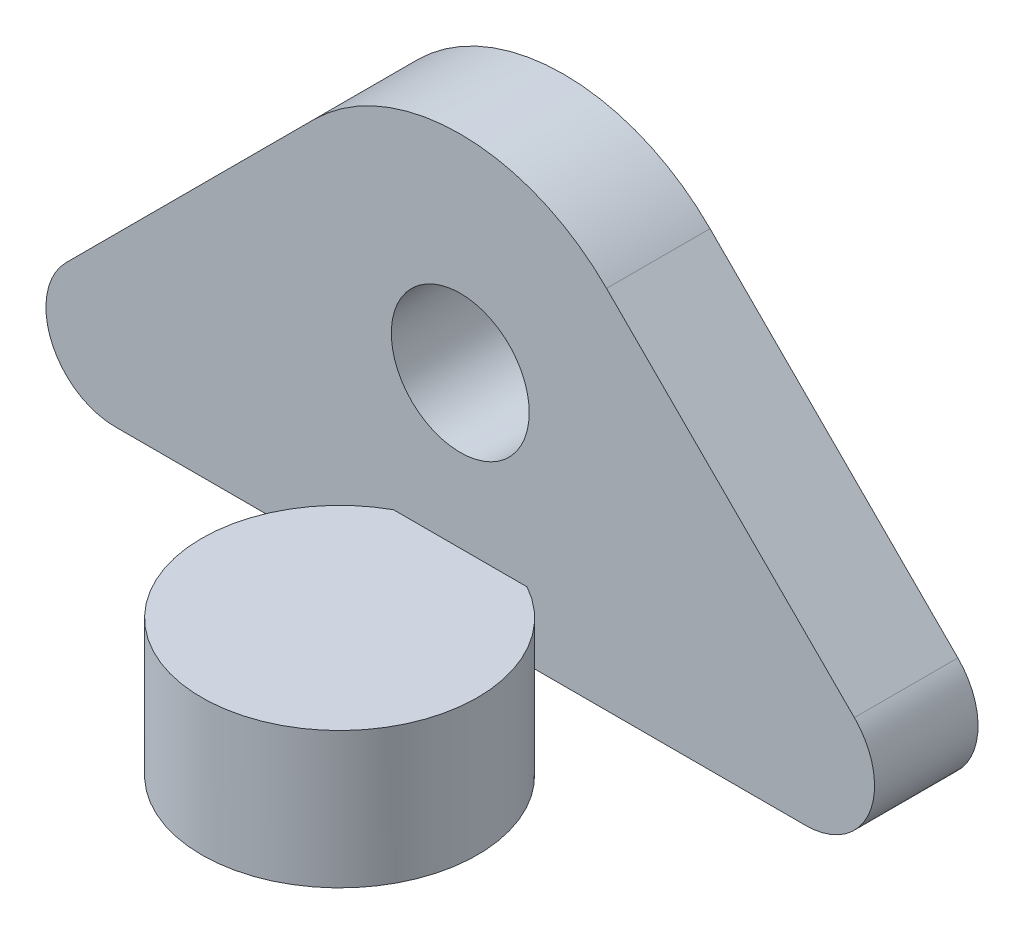
ISO-10303-21;
HEADER;
FILE_DESCRIPTION(('STEP AP214'),'2;1');
FILE_NAME('part.step','',(''),(''),'','','');
FILE_SCHEMA(('AUTOMOTIVE_DESIGN { 1 0 10303 214 1 1 1 1 }'));
ENDSEC;
DATA;
#1=APPLICATION_CONTEXT('core data for automotive mechanical design processes');
#2=APPLICATION_PROTOCOL_DEFINITION('international standard','automotive_design',2000,#1);
#3=PRODUCT_CONTEXT('',#1,'mechanical');
#4=PRODUCT('Part','Part','',(#3));
#5=PRODUCT_RELATED_PRODUCT_CATEGORY('part','',(#4));
#6=PRODUCT_DEFINITION_FORMATION('','',#4);
#7=PRODUCT_DEFINITION_CONTEXT('part definition',#1,'design');
#8=PRODUCT_DEFINITION('design','',#6,#7);
#9=PRODUCT_DEFINITION_SHAPE('','',#8);
#10=(LENGTH_UNIT() NAMED_UNIT(*) SI_UNIT(.MILLI.,.METRE.));
#11=(NAMED_UNIT(*) PLANE_ANGLE_UNIT() SI_UNIT($,.RADIAN.));
#12=(NAMED_UNIT(*) SI_UNIT($,.STERADIAN.) SOLID_ANGLE_UNIT());
#13=UNCERTAINTY_MEASURE_WITH_UNIT(LENGTH_MEASURE(1.E-05),#10,'distance_accuracy_value','');
#14=(GEOMETRIC_REPRESENTATION_CONTEXT(3) GLOBAL_UNCERTAINTY_ASSIGNED_CONTEXT((#13)) GLOBAL_UNIT_ASSIGNED_CONTEXT((#10,
#11,#12)) REPRESENTATION_CONTEXT('',''));
#15=CARTESIAN_POINT('',(0.,0.,0.));
#16=DIRECTION('',(0.,0.,1.));
#17=DIRECTION('',(1.,0.,0.));
#18=AXIS2_PLACEMENT_3D('',#15,#16,#17);
#19=CARTESIAN_POINT('',(-8.0772,-3.51536,-2.42062));
#20=DIRECTION('',(0.,0.,1.));
#21=DIRECTION('',(1.,0.,0.));
#22=AXIS2_PLACEMENT_3D('',#19,#20,#21);
#23=CYLINDRICAL_SURFACE('',#22,1.6129);
#24=CARTESIAN_POINT('',(-8.0772,-3.51536,0.));
#25=DIRECTION('',(0.,0.,1.));
#26=DIRECTION('',(1.,0.,0.));
#27=AXIS2_PLACEMENT_3D('',#24,#25,#26);
#28=CIRCLE('',#27,1.6129);
#29=CARTESIAN_POINT('',(-9.21770532769004,-2.37488027308214,0.));
#30=VERTEX_POINT('',#29);
#31=CARTESIAN_POINT('',(-8.0772,-5.12826,0.));
#32=VERTEX_POINT('',#31);
#33=EDGE_CURVE('E130',#30,#32,#28,.T.);
#34=ORIENTED_EDGE('',*,*,#33,.F.);
#35=DIRECTION('',(0.,0.,1.));
#36=VECTOR('',#35,1.);
#37=CARTESIAN_POINT('',(-9.21770532769004,-2.37488027308214,-2.42062));
#38=LINE('',#37,#36);
#39=CARTESIAN_POINT('',(-9.21770532769004,-2.37488027308214,-2.42062));
#40=VERTEX_POINT('',#39);
#41=EDGE_CURVE('E54',#40,#30,#38,.T.);
#42=ORIENTED_EDGE('',*,*,#41,.F.);
#43=CARTESIAN_POINT('',(-8.0772,-3.51536,-2.42062));
#44=DIRECTION('',(0.,0.,1.));
#45=DIRECTION('',(1.,0.,0.));
#46=AXIS2_PLACEMENT_3D('',#43,#44,#45);
#47=CIRCLE('',#46,1.6129);
#48=CARTESIAN_POINT('',(-8.0772,-5.12826,-2.42062));
#49=VERTEX_POINT('',#48);
#50=EDGE_CURVE('E147',#40,#49,#47,.T.);
#51=ORIENTED_EDGE('',*,*,#50,.T.);
#52=DIRECTION('',(0.,0.,1.));
#53=VECTOR('',#52,1.);
#54=CARTESIAN_POINT('',(-8.0772,-5.12826,-2.42062));
#55=LINE('',#54,#53);
#56=EDGE_CURVE('E87',#49,#32,#55,.T.);
#57=ORIENTED_EDGE('',*,*,#56,.T.);
#58=EDGE_LOOP('',(#34,#42,#51,#57));
#59=FACE_BOUND('',#58,.T.);
#60=ADVANCED_FACE('F32',(#59),#23,.T.);
#61=CARTESIAN_POINT('',(-9.21770532769004,-2.37488027308214,-2.42062));
#62=DIRECTION('',(-0.707114717397258,0.707098844886764,0.));
#63=DIRECTION('',(-0.707098844886764,-0.707114717397258,0.));
#64=AXIS2_PLACEMENT_3D('',#61,#62,#63);
#65=PLANE('',#64);
#66=DIRECTION('',(-0.707098844886764,-0.707114717397258,0.));
#67=VECTOR('',#66,1.);
#68=CARTESIAN_POINT('',(-9.21770532769004,-2.37488027308214,0.));
#69=LINE('',#68,#67);
#70=CARTESIAN_POINT('',(-3.42151598307011,3.42143918075358,0.));
#71=VERTEX_POINT('',#70);
#72=EDGE_CURVE('E144',#71,#30,#69,.T.);
#73=ORIENTED_EDGE('',*,*,#72,.F.);
#74=DIRECTION('',(0.,0.,1.));
#75=VECTOR('',#74,1.);
#76=CARTESIAN_POINT('',(-3.42151598307011,3.42143918075358,-2.42062));
#77=LINE('',#76,#75);
#78=CARTESIAN_POINT('',(-3.42151598307011,3.42143918075358,-2.42062));
#79=VERTEX_POINT('',#78);
#80=EDGE_CURVE('E111',#79,#71,#77,.T.);
#81=ORIENTED_EDGE('',*,*,#80,.F.);
#82=DIRECTION('',(-0.707098844886764,-0.707114717397258,0.));
#83=VECTOR('',#82,1.);
#84=CARTESIAN_POINT('',(-9.21770532769004,-2.37488027308214,-2.42062));
#85=LINE('',#84,#83);
#86=EDGE_CURVE('E120',#79,#40,#85,.T.);
#87=ORIENTED_EDGE('',*,*,#86,.T.);
#88=ORIENTED_EDGE('',*,*,#41,.T.);
#89=EDGE_LOOP('',(#73,#81,#87,#88));
#90=FACE_BOUND('',#89,.T.);
#91=ADVANCED_FACE('F217',(#90),#65,.T.);
#92=CARTESIAN_POINT('',(0.,0.,-2.42062));
#93=DIRECTION('',(0.,0.,1.));
#94=DIRECTION('',(1.,0.,0.));
#95=AXIS2_PLACEMENT_3D('',#92,#93,#94);
#96=CYLINDRICAL_SURFACE('',#95,4.8387);
#97=CARTESIAN_POINT('',(0.,0.,0.));
#98=DIRECTION('',(0.,0.,1.));
#99=DIRECTION('',(1.,0.,0.));
#100=AXIS2_PLACEMENT_3D('',#97,#98,#99);
#101=CIRCLE('',#100,4.8387);
#102=CARTESIAN_POINT('',(3.42151598307011,3.42143918075358,0.));
#103=VERTEX_POINT('',#102);
#104=EDGE_CURVE('E106',#103,#71,#101,.T.);
#105=ORIENTED_EDGE('',*,*,#104,.F.);
#106=DIRECTION('',(0.,0.,1.));
#107=VECTOR('',#106,1.);
#108=CARTESIAN_POINT('',(3.42151598307011,3.42143918075358,-2.42062));
#109=LINE('',#108,#107);
#110=CARTESIAN_POINT('',(3.42151598307011,3.42143918075358,-2.42062));
#111=VERTEX_POINT('',#110);
#112=EDGE_CURVE('E100',#111,#103,#109,.T.);
#113=ORIENTED_EDGE('',*,*,#112,.F.);
#114=CARTESIAN_POINT('',(0.,0.,-2.42062));
#115=DIRECTION('',(0.,0.,1.));
#116=DIRECTION('',(1.,0.,0.));
#117=AXIS2_PLACEMENT_3D('',#114,#115,#116);
#118=CIRCLE('',#117,4.8387);
#119=EDGE_CURVE('E103',#111,#79,#118,.T.);
#120=ORIENTED_EDGE('',*,*,#119,.T.);
#121=ORIENTED_EDGE('',*,*,#80,.T.);
#122=EDGE_LOOP('',(#105,#113,#120,#121));
#123=FACE_BOUND('',#122,.T.);
#124=ADVANCED_FACE('F102',(#123),#96,.T.);
#125=CARTESIAN_POINT('',(3.42151598307011,3.42143918075358,-2.42062));
#126=DIRECTION('',(0.707114717397258,0.707098844886764,0.));
#127=DIRECTION('',(-0.707098844886764,0.707114717397258,0.));
#128=AXIS2_PLACEMENT_3D('',#125,#126,#127);
#129=PLANE('',#128);
#130=DIRECTION('',(-0.707098844886764,0.707114717397258,0.));
#131=VECTOR('',#130,1.);
#132=CARTESIAN_POINT('',(3.42151598307011,3.42143918075358,0.));
#133=LINE('',#132,#131);
#134=CARTESIAN_POINT('',(9.21770532769004,-2.37488027308214,0.));
#135=VERTEX_POINT('',#134);
#136=EDGE_CURVE('E141',#135,#103,#133,.T.);
#137=ORIENTED_EDGE('',*,*,#136,.F.);
#138=DIRECTION('',(0.,0.,1.));
#139=VECTOR('',#138,1.);
#140=CARTESIAN_POINT('',(9.21770532769004,-2.37488027308214,-2.42062));
#141=LINE('',#140,#139);
#142=CARTESIAN_POINT('',(9.21770532769004,-2.37488027308214,-2.42062));
#143=VERTEX_POINT('',#142);
#144=EDGE_CURVE('E112',#143,#135,#141,.T.);
#145=ORIENTED_EDGE('',*,*,#144,.F.);
#146=DIRECTION('',(-0.707098844886764,0.707114717397258,0.));
#147=VECTOR('',#146,1.);
#148=CARTESIAN_POINT('',(3.42151598307011,3.42143918075358,-2.42062));
#149=LINE('',#148,#147);
#150=EDGE_CURVE('E118',#143,#111,#149,.T.);
#151=ORIENTED_EDGE('',*,*,#150,.T.);
#152=ORIENTED_EDGE('',*,*,#112,.T.);
#153=EDGE_LOOP('',(#137,#145,#151,#152));
#154=FACE_BOUND('',#153,.T.);
#155=ADVANCED_FACE('F122',(#154),#129,.T.);
#156=CARTESIAN_POINT('',(8.0772,-3.51536,-2.42062));
#157=DIRECTION('',(0.,0.,1.));
#158=DIRECTION('',(1.,0.,0.));
#159=AXIS2_PLACEMENT_3D('',#156,#157,#158);
#160=CYLINDRICAL_SURFACE('',#159,1.6129);
#161=CARTESIAN_POINT('',(8.0772,-3.51536,0.));
#162=DIRECTION('',(0.,0.,1.));
#163=DIRECTION('',(1.,0.,0.));
#164=AXIS2_PLACEMENT_3D('',#161,#162,#163);
#165=CIRCLE('',#164,1.6129);
#166=CARTESIAN_POINT('',(8.0772,-5.12826,0.));
#167=VERTEX_POINT('',#166);
#168=EDGE_CURVE('E138',#167,#135,#165,.T.);
#169=ORIENTED_EDGE('',*,*,#168,.F.);
#170=DIRECTION('',(0.,0.,1.));
#171=VECTOR('',#170,1.);
#172=CARTESIAN_POINT('',(8.0772,-5.12826,-2.42062));
#173=LINE('',#172,#171);
#174=CARTESIAN_POINT('',(8.0772,-5.12826,-2.42062));
#175=VERTEX_POINT('',#174);
#176=EDGE_CURVE('E152',#175,#167,#173,.T.);
#177=ORIENTED_EDGE('',*,*,#176,.F.);
#178=CARTESIAN_POINT('',(8.0772,-3.51536,-2.42062));
#179=DIRECTION('',(0.,0.,1.));
#180=DIRECTION('',(1.,0.,0.));
#181=AXIS2_PLACEMENT_3D('',#178,#179,#180);
#182=CIRCLE('',#181,1.6129);
#183=EDGE_CURVE('E123',#175,#143,#182,.T.);
#184=ORIENTED_EDGE('',*,*,#183,.T.);
#185=ORIENTED_EDGE('',*,*,#144,.T.);
#186=EDGE_LOOP('',(#169,#177,#184,#185));
#187=FACE_BOUND('',#186,.T.);
#188=ADVANCED_FACE('F231',(#187),#160,.T.);
#189=CARTESIAN_POINT('',(-8.0772,-5.12826,-2.42062));
#190=DIRECTION('',(0.,-1.,0.));
#191=DIRECTION('',(0.,0.,-1.));
#192=AXIS2_PLACEMENT_3D('',#189,#190,#191);
#193=PLANE('',#192);
#194=CARTESIAN_POINT('',(0.,-5.12826,2.82194));
#195=DIRECTION('',(0.,-1.,0.));
#196=DIRECTION('',(0.,0.,-1.));
#197=AXIS2_PLACEMENT_3D('',#194,#195,#196);
#198=CIRCLE('',#197,3.2258);
#199=CARTESIAN_POINT('',(-1.56283085341952,-5.12826,0.));
#200=VERTEX_POINT('',#199);
#201=CARTESIAN_POINT('',(1.56283085341952,-5.12826,0.));
#202=VERTEX_POINT('',#201);
#203=EDGE_CURVE('E166',#200,#202,#198,.T.);
#204=ORIENTED_EDGE('',*,*,#203,.F.);
#205=DIRECTION('',(1.,0.,0.));
#206=VECTOR('',#205,1.);
#207=CARTESIAN_POINT('',(-8.0772,-5.12826,0.));
#208=LINE('',#207,#206);
#209=EDGE_CURVE('E135',#32,#200,#208,.T.);
#210=ORIENTED_EDGE('',*,*,#209,.F.);
#211=ORIENTED_EDGE('',*,*,#56,.F.);
#212=DIRECTION('',(1.,0.,0.));
#213=VECTOR('',#212,1.);
#214=CARTESIAN_POINT('',(-8.0772,-5.12826,-2.42062));
#215=LINE('',#214,#213);
#216=EDGE_CURVE('E125',#49,#175,#215,.T.);
#217=ORIENTED_EDGE('',*,*,#216,.T.);
#218=ORIENTED_EDGE('',*,*,#176,.T.);
#219=EDGE_CURVE('E133',#202,#167,#208,.T.);
#220=ORIENTED_EDGE('',*,*,#219,.F.);
#221=EDGE_LOOP('',(#204,#210,#211,#217,#218,#220));
#222=FACE_BOUND('',#221,.T.);
#223=ADVANCED_FACE('F173',(#222),#193,.T.);
#224=CARTESIAN_POINT('',(-8.0772,-3.51536,-2.42062));
#225=DIRECTION('',(0.,0.,1.));
#226=DIRECTION('',(1.,0.,0.));
#227=AXIS2_PLACEMENT_3D('',#224,#225,#226);
#228=PLANE('',#227);
#229=CARTESIAN_POINT('',(0.,0.,-2.42062));
#230=DIRECTION('',(0.,0.,1.));
#231=DIRECTION('',(1.,0.,0.));
#232=AXIS2_PLACEMENT_3D('',#229,#230,#231);
#233=CIRCLE('',#232,1.6129);
#234=CARTESIAN_POINT('',(1.6129,0.,-2.42062));
#235=VERTEX_POINT('',#234);
#236=EDGE_CURVE('E134',#235,#235,#233,.T.);
#237=ORIENTED_EDGE('',*,*,#236,.T.);
#238=EDGE_LOOP('',(#237));
#239=FACE_BOUND('',#238,.T.);
#240=ORIENTED_EDGE('',*,*,#50,.F.);
#241=ORIENTED_EDGE('',*,*,#86,.F.);
#242=ORIENTED_EDGE('',*,*,#119,.F.);
#243=ORIENTED_EDGE('',*,*,#150,.F.);
#244=ORIENTED_EDGE('',*,*,#183,.F.);
#245=ORIENTED_EDGE('',*,*,#216,.F.);
#246=EDGE_LOOP('',(#240,#241,#242,#243,#244,#245));
#247=FACE_BOUND('',#246,.T.);
#248=ADVANCED_FACE('F116',(#239,#247),#228,.F.);
#249=CARTESIAN_POINT('',(-8.0772,-3.51536,0.));
#250=DIRECTION('',(0.,0.,1.));
#251=DIRECTION('',(1.,0.,0.));
#252=AXIS2_PLACEMENT_3D('',#249,#250,#251);
#253=PLANE('',#252);
#254=DIRECTION('',(0.,-1.,0.));
#255=VECTOR('',#254,1.);
#256=CARTESIAN_POINT('',(-1.56283085341952,-3.55346,0.));
#257=LINE('',#256,#255);
#258=CARTESIAN_POINT('',(-1.56283085341952,-3.55346,0.));
#259=VERTEX_POINT('',#258);
#260=EDGE_CURVE('E11',#259,#200,#257,.T.);
#261=ORIENTED_EDGE('',*,*,#260,.F.);
#262=DIRECTION('',(1.,0.,0.));
#263=VECTOR('',#262,1.);
#264=CARTESIAN_POINT('',(-8.0772,-3.55346,0.));
#265=LINE('',#264,#263);
#266=CARTESIAN_POINT('',(1.56283085341952,-3.55346,0.));
#267=VERTEX_POINT('',#266);
#268=EDGE_CURVE('E149',#259,#267,#265,.T.);
#269=ORIENTED_EDGE('',*,*,#268,.T.);
#270=DIRECTION('',(0.,-1.,0.));
#271=VECTOR('',#270,1.);
#272=CARTESIAN_POINT('',(1.56283085341952,-3.55346,0.));
#273=LINE('',#272,#271);
#274=EDGE_CURVE('E39',#202,#267,#273,.F.);
#275=ORIENTED_EDGE('',*,*,#274,.F.);
#276=ORIENTED_EDGE('',*,*,#219,.T.);
#277=ORIENTED_EDGE('',*,*,#168,.T.);
#278=ORIENTED_EDGE('',*,*,#136,.T.);
#279=ORIENTED_EDGE('',*,*,#104,.T.);
#280=ORIENTED_EDGE('',*,*,#72,.T.);
#281=ORIENTED_EDGE('',*,*,#33,.T.);
#282=ORIENTED_EDGE('',*,*,#209,.T.);
#283=EDGE_LOOP('',(#261,#269,#275,#276,#277,#278,#279,#280,#281,#282));
#284=FACE_BOUND('',#283,.T.);
#285=CARTESIAN_POINT('',(0.,0.,0.));
#286=DIRECTION('',(0.,0.,1.));
#287=DIRECTION('',(1.,0.,0.));
#288=AXIS2_PLACEMENT_3D('',#285,#286,#287);
#289=CIRCLE('',#288,1.6129);
#290=CARTESIAN_POINT('',(1.6129,0.,0.));
#291=VERTEX_POINT('',#290);
#292=EDGE_CURVE('E174',#291,#291,#289,.T.);
#293=ORIENTED_EDGE('',*,*,#292,.F.);
#294=EDGE_LOOP('',(#293));
#295=FACE_BOUND('',#294,.T.);
#296=ADVANCED_FACE('F169',(#284,#295),#253,.T.);
#297=CARTESIAN_POINT('',(0.,0.,-2.42062));
#298=DIRECTION('',(0.,0.,1.));
#299=DIRECTION('',(1.,0.,0.));
#300=AXIS2_PLACEMENT_3D('',#297,#298,#299);
#301=CYLINDRICAL_SURFACE('',#300,1.6129);
#302=ORIENTED_EDGE('',*,*,#236,.F.);
#303=EDGE_LOOP('',(#302));
#304=FACE_BOUND('',#303,.T.);
#305=ORIENTED_EDGE('',*,*,#292,.T.);
#306=EDGE_LOOP('',(#305));
#307=FACE_BOUND('',#306,.T.);
#308=ADVANCED_FACE('F207',(#304,#307),#301,.F.);
#309=CARTESIAN_POINT('',(0.,-3.55346,2.82194));
#310=DIRECTION('',(0.,-1.,0.));
#311=DIRECTION('',(0.,0.,-1.));
#312=AXIS2_PLACEMENT_3D('',#309,#310,#311);
#313=CYLINDRICAL_SURFACE('',#312,3.2258);
#314=CARTESIAN_POINT('',(0.,-3.55346,2.82194));
#315=DIRECTION('',(0.,-1.,0.));
#316=DIRECTION('',(0.,0.,-1.));
#317=AXIS2_PLACEMENT_3D('',#314,#315,#316);
#318=CIRCLE('',#317,3.2258);
#319=EDGE_CURVE('E45',#267,#259,#318,.T.);
#320=ORIENTED_EDGE('',*,*,#319,.T.);
#321=ORIENTED_EDGE('',*,*,#260,.T.);
#322=ORIENTED_EDGE('',*,*,#203,.T.);
#323=ORIENTED_EDGE('',*,*,#274,.T.);
#324=EDGE_LOOP('',(#320,#321,#322,#323));
#325=FACE_BOUND('',#324,.T.);
#326=CARTESIAN_POINT('',(0.,-6.74116,2.82194));
#327=DIRECTION('',(0.,-1.,0.));
#328=DIRECTION('',(0.,0.,-1.));
#329=AXIS2_PLACEMENT_3D('',#326,#327,#328);
#330=CIRCLE('',#329,3.2258);
#331=CARTESIAN_POINT('',(0.,-6.74116,-0.40386));
#332=VERTEX_POINT('',#331);
#333=EDGE_CURVE('E183',#332,#332,#330,.T.);
#334=ORIENTED_EDGE('',*,*,#333,.F.);
#335=EDGE_LOOP('',(#334));
#336=FACE_BOUND('',#335,.T.);
#337=ADVANCED_FACE('F160',(#325,#336),#313,.T.);
#338=CARTESIAN_POINT('',(0.,-3.55346,2.82194));
#339=DIRECTION('',(0.,-1.,0.));
#340=DIRECTION('',(0.,0.,-1.));
#341=AXIS2_PLACEMENT_3D('',#338,#339,#340);
#342=PLANE('',#341);
#343=ORIENTED_EDGE('',*,*,#268,.F.);
#344=ORIENTED_EDGE('',*,*,#319,.F.);
#345=EDGE_LOOP('',(#343,#344));
#346=FACE_BOUND('',#345,.T.);
#347=ADVANCED_FACE('F171',(#346),#342,.F.);
#348=CARTESIAN_POINT('',(0.,-6.74116,2.82194));
#349=DIRECTION('',(0.,-1.,0.));
#350=DIRECTION('',(0.,0.,-1.));
#351=AXIS2_PLACEMENT_3D('',#348,#349,#350);
#352=PLANE('',#351);
#353=CARTESIAN_POINT('',(0.,-6.74116,2.82194));
#354=DIRECTION('',(0.,-1.,0.));
#355=DIRECTION('',(0.,0.,-1.));
#356=AXIS2_PLACEMENT_3D('',#353,#354,#355);
#357=CIRCLE('',#356,2.42062);
#358=CARTESIAN_POINT('',(0.,-6.74116,0.401320000000001));
#359=VERTEX_POINT('',#358);
#360=EDGE_CURVE('E187',#359,#359,#357,.T.);
#361=ORIENTED_EDGE('',*,*,#360,.F.);
#362=EDGE_LOOP('',(#361));
#363=FACE_BOUND('',#362,.T.);
#364=ORIENTED_EDGE('',*,*,#333,.T.);
#365=EDGE_LOOP('',(#364));
#366=FACE_BOUND('',#365,.T.);
#367=ADVANCED_FACE('F198',(#363,#366),#352,.T.);
#368=CARTESIAN_POINT('',(0.,-4.32054,2.82194));
#369=DIRECTION('',(0.,-1.,0.));
#370=DIRECTION('',(0.,0.,-1.));
#371=AXIS2_PLACEMENT_3D('',#368,#369,#370);
#372=CYLINDRICAL_SURFACE('',#371,2.42062);
#373=CARTESIAN_POINT('',(0.,-4.32054,2.82194));
#374=DIRECTION('',(0.,-1.,0.));
#375=DIRECTION('',(0.,0.,-1.));
#376=AXIS2_PLACEMENT_3D('',#373,#374,#375);
#377=CIRCLE('',#376,2.42062);
#378=CARTESIAN_POINT('',(0.,-4.32054,0.401320000000001));
#379=VERTEX_POINT('',#378);
#380=EDGE_CURVE('E186',#379,#379,#377,.T.);
#381=ORIENTED_EDGE('',*,*,#380,.F.);
#382=EDGE_LOOP('',(#381));
#383=FACE_BOUND('',#382,.T.);
#384=ORIENTED_EDGE('',*,*,#360,.T.);
#385=EDGE_LOOP('',(#384));
#386=FACE_BOUND('',#385,.T.);
#387=ADVANCED_FACE('F195',(#383,#386),#372,.F.);
#388=CARTESIAN_POINT('',(0.,-4.32054,2.82194));
#389=DIRECTION('',(0.,-1.,0.));
#390=DIRECTION('',(0.,0.,-1.));
#391=AXIS2_PLACEMENT_3D('',#388,#389,#390);
#392=PLANE('',#391);
#393=ORIENTED_EDGE('',*,*,#380,.T.);
#394=EDGE_LOOP('',(#393));
#395=FACE_BOUND('',#394,.T.);
#396=ADVANCED_FACE('F193',(#395),#392,.T.);
#397=CLOSED_SHELL('',(#60,#91,#124,#155,#188,#223,#248,#296,#308,#337,#347,#367,#387,#396));
#398=MANIFOLD_SOLID_BREP('B2',#397);
#399=ADVANCED_BREP_SHAPE_REPRESENTATION('',(#18,#398),#14);
#400=SHAPE_DEFINITION_REPRESENTATION(#9,#399);
ENDSEC;
END-ISO-10303-21;
